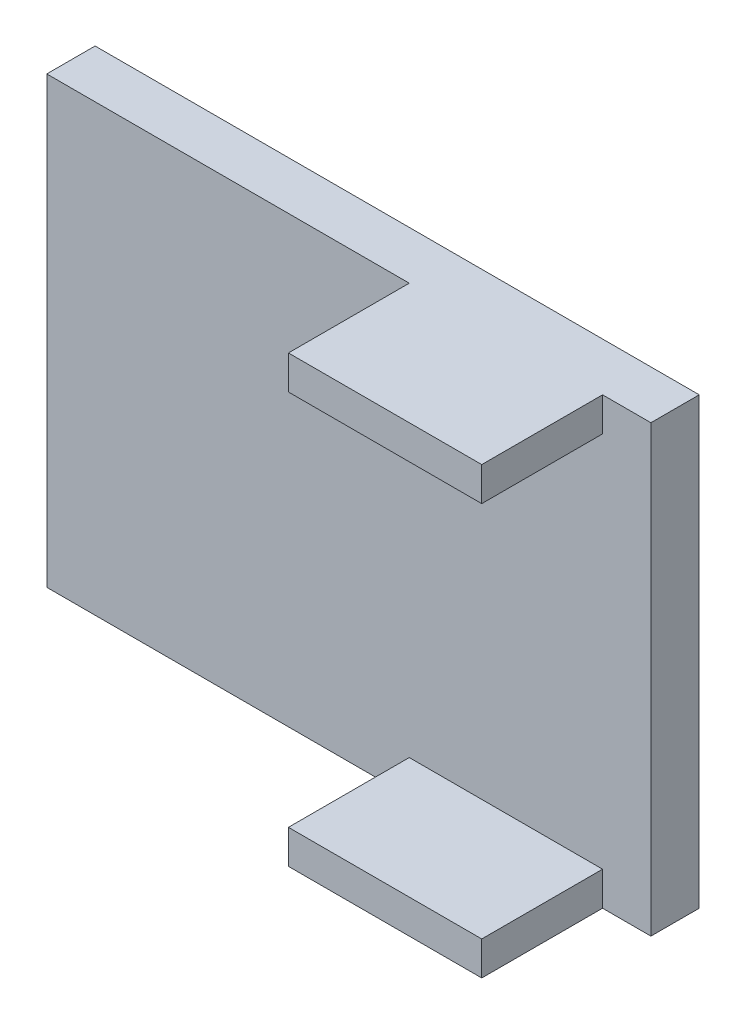
ISO-10303-21;
HEADER;
FILE_DESCRIPTION(('STEP AP214'),'2;1');
FILE_NAME('part.step','',(''),(''),'','','');
FILE_SCHEMA(('AUTOMOTIVE_DESIGN { 1 0 10303 214 1 1 1 1 }'));
ENDSEC;
DATA;
#1=APPLICATION_CONTEXT('core data for automotive mechanical design processes');
#2=APPLICATION_PROTOCOL_DEFINITION('international standard','automotive_design',2000,#1);
#3=PRODUCT_CONTEXT('',#1,'mechanical');
#4=PRODUCT('Part','Part','',(#3));
#5=PRODUCT_RELATED_PRODUCT_CATEGORY('part','',(#4));
#6=PRODUCT_DEFINITION_FORMATION('','',#4);
#7=PRODUCT_DEFINITION_CONTEXT('part definition',#1,'design');
#8=PRODUCT_DEFINITION('design','',#6,#7);
#9=PRODUCT_DEFINITION_SHAPE('','',#8);
#10=(LENGTH_UNIT() NAMED_UNIT(*) SI_UNIT(.MILLI.,.METRE.));
#11=(NAMED_UNIT(*) PLANE_ANGLE_UNIT() SI_UNIT($,.RADIAN.));
#12=(NAMED_UNIT(*) SI_UNIT($,.STERADIAN.) SOLID_ANGLE_UNIT());
#13=UNCERTAINTY_MEASURE_WITH_UNIT(LENGTH_MEASURE(1.E-05),#10,'distance_accuracy_value','');
#14=(GEOMETRIC_REPRESENTATION_CONTEXT(3) GLOBAL_UNCERTAINTY_ASSIGNED_CONTEXT((#13)) GLOBAL_UNIT_ASSIGNED_CONTEXT((#10,
#11,#12)) REPRESENTATION_CONTEXT('',''));
#15=CARTESIAN_POINT('',(0.,0.,0.));
#16=DIRECTION('',(0.,0.,1.));
#17=DIRECTION('',(1.,0.,0.));
#18=AXIS2_PLACEMENT_3D('',#15,#16,#17);
#19=CARTESIAN_POINT('',(0.,0.,2.54));
#20=DIRECTION('',(0.,0.,-1.));
#21=DIRECTION('',(-1.,0.,0.));
#22=AXIS2_PLACEMENT_3D('',#19,#20,#21);
#23=PLANE('',#22);
#24=DIRECTION('',(-1.,0.,0.));
#25=VECTOR('',#24,1.);
#26=CARTESIAN_POINT('',(15.875,-9.90599999999999,2.54));
#27=LINE('',#26,#25);
#28=CARTESIAN_POINT('',(13.335,-9.90599999999999,2.54));
#29=VERTEX_POINT('',#28);
#30=CARTESIAN_POINT('',(3.17500000000001,-9.90599999999999,2.54));
#31=VERTEX_POINT('',#30);
#32=EDGE_CURVE('E204',#29,#31,#27,.T.);
#33=ORIENTED_EDGE('',*,*,#32,.F.);
#34=DIRECTION('',(0.,1.,0.));
#35=VECTOR('',#34,1.);
#36=CARTESIAN_POINT('',(13.335,-11.684,2.54));
#37=LINE('',#36,#35);
#38=CARTESIAN_POINT('',(13.335,-11.684,2.54));
#39=VERTEX_POINT('',#38);
#40=EDGE_CURVE('E136',#39,#29,#37,.T.);
#41=ORIENTED_EDGE('',*,*,#40,.F.);
#42=DIRECTION('',(-1.,0.,0.));
#43=VECTOR('',#42,1.);
#44=CARTESIAN_POINT('',(15.875,-11.684,2.54));
#45=LINE('',#44,#43);
#46=CARTESIAN_POINT('',(15.875,-11.684,2.54));
#47=VERTEX_POINT('',#46);
#48=EDGE_CURVE('E134',#47,#39,#45,.T.);
#49=ORIENTED_EDGE('',*,*,#48,.F.);
#50=DIRECTION('',(0.,1.,0.));
#51=VECTOR('',#50,1.);
#52=CARTESIAN_POINT('',(15.875,-11.684,2.54));
#53=LINE('',#52,#51);
#54=CARTESIAN_POINT('',(15.875,11.684,2.54));
#55=VERTEX_POINT('',#54);
#56=EDGE_CURVE('E121',#47,#55,#53,.T.);
#57=ORIENTED_EDGE('',*,*,#56,.T.);
#58=DIRECTION('',(-1.,0.,0.));
#59=VECTOR('',#58,1.);
#60=CARTESIAN_POINT('',(15.875,11.684,2.54));
#61=LINE('',#60,#59);
#62=CARTESIAN_POINT('',(13.335,11.684,2.54));
#63=VERTEX_POINT('',#62);
#64=EDGE_CURVE('E221',#55,#63,#61,.T.);
#65=ORIENTED_EDGE('',*,*,#64,.T.);
#66=CARTESIAN_POINT('',(13.335,9.90600000000001,2.54));
#67=VERTEX_POINT('',#66);
#68=EDGE_CURVE('E218',#67,#63,#37,.T.);
#69=ORIENTED_EDGE('',*,*,#68,.F.);
#70=DIRECTION('',(1.,0.,0.));
#71=VECTOR('',#70,1.);
#72=CARTESIAN_POINT('',(15.875,9.90600000000001,2.54));
#73=LINE('',#72,#71);
#74=CARTESIAN_POINT('',(3.175,9.90600000000001,2.54));
#75=VERTEX_POINT('',#74);
#76=EDGE_CURVE('E181',#75,#67,#73,.T.);
#77=ORIENTED_EDGE('',*,*,#76,.F.);
#78=DIRECTION('',(0.,-1.,0.));
#79=VECTOR('',#78,1.);
#80=CARTESIAN_POINT('',(3.175,11.684,2.54));
#81=LINE('',#80,#79);
#82=CARTESIAN_POINT('',(3.175,11.684,2.54));
#83=VERTEX_POINT('',#82);
#84=EDGE_CURVE('E185',#83,#75,#81,.T.);
#85=ORIENTED_EDGE('',*,*,#84,.F.);
#86=DIRECTION('',(-1.,0.,0.));
#87=VECTOR('',#86,1.);
#88=CARTESIAN_POINT('',(-15.875,11.684,2.54));
#89=LINE('',#88,#87);
#90=CARTESIAN_POINT('',(-15.875,11.684,2.54));
#91=VERTEX_POINT('',#90);
#92=EDGE_CURVE('E130',#83,#91,#89,.T.);
#93=ORIENTED_EDGE('',*,*,#92,.T.);
#94=DIRECTION('',(0.,-1.,0.));
#95=VECTOR('',#94,1.);
#96=CARTESIAN_POINT('',(-15.875,-11.684,2.54));
#97=LINE('',#96,#95);
#98=CARTESIAN_POINT('',(-15.875,-11.684,2.54));
#99=VERTEX_POINT('',#98);
#100=EDGE_CURVE('E150',#91,#99,#97,.T.);
#101=ORIENTED_EDGE('',*,*,#100,.T.);
#102=DIRECTION('',(1.,0.,0.));
#103=VECTOR('',#102,1.);
#104=CARTESIAN_POINT('',(-15.875,-11.684,2.54));
#105=LINE('',#104,#103);
#106=CARTESIAN_POINT('',(3.17500000000001,-11.684,2.54));
#107=VERTEX_POINT('',#106);
#108=EDGE_CURVE('E147',#99,#107,#105,.T.);
#109=ORIENTED_EDGE('',*,*,#108,.T.);
#110=DIRECTION('',(0.,-1.,0.));
#111=VECTOR('',#110,1.);
#112=CARTESIAN_POINT('',(3.17500000000001,-11.684,2.54));
#113=LINE('',#112,#111);
#114=EDGE_CURVE('E200',#31,#107,#113,.T.);
#115=ORIENTED_EDGE('',*,*,#114,.F.);
#116=EDGE_LOOP('',(#33,#41,#49,#57,#65,#69,#77,#85,#93,#101,#109,#115));
#117=FACE_BOUND('',#116,.T.);
#118=ADVANCED_FACE('F34',(#117),#23,.F.);
#119=CARTESIAN_POINT('',(15.875,-11.684,2.54));
#120=DIRECTION('',(-1.,0.,0.));
#121=DIRECTION('',(0.,0.,1.));
#122=AXIS2_PLACEMENT_3D('',#119,#120,#121);
#123=PLANE('',#122);
#124=DIRECTION('',(0.,0.,-1.));
#125=VECTOR('',#124,1.);
#126=CARTESIAN_POINT('',(15.875,11.684,2.54));
#127=LINE('',#126,#125);
#128=CARTESIAN_POINT('',(15.875,11.684,0.));
#129=VERTEX_POINT('',#128);
#130=EDGE_CURVE('E11',#55,#129,#127,.T.);
#131=ORIENTED_EDGE('',*,*,#130,.F.);
#132=ORIENTED_EDGE('',*,*,#56,.F.);
#133=DIRECTION('',(0.,0.,-1.));
#134=VECTOR('',#133,1.);
#135=CARTESIAN_POINT('',(15.875,-11.684,2.54));
#136=LINE('',#135,#134);
#137=CARTESIAN_POINT('',(15.875,-11.684,0.));
#138=VERTEX_POINT('',#137);
#139=EDGE_CURVE('E125',#47,#138,#136,.T.);
#140=ORIENTED_EDGE('',*,*,#139,.T.);
#141=DIRECTION('',(0.,1.,0.));
#142=VECTOR('',#141,1.);
#143=CARTESIAN_POINT('',(15.875,-11.684,0.));
#144=LINE('',#143,#142);
#145=EDGE_CURVE('E168',#138,#129,#144,.T.);
#146=ORIENTED_EDGE('',*,*,#145,.T.);
#147=EDGE_LOOP('',(#131,#132,#140,#146));
#148=FACE_BOUND('',#147,.T.);
#149=ADVANCED_FACE('F36',(#148),#123,.F.);
#150=CARTESIAN_POINT('',(-15.875,11.684,2.54));
#151=DIRECTION('',(0.,-1.,0.));
#152=DIRECTION('',(0.,0.,-1.));
#153=AXIS2_PLACEMENT_3D('',#150,#151,#152);
#154=PLANE('',#153);
#155=DIRECTION('',(-1.,0.,0.));
#156=VECTOR('',#155,1.);
#157=CARTESIAN_POINT('',(15.875,11.684,8.89));
#158=LINE('',#157,#156);
#159=CARTESIAN_POINT('',(13.335,11.684,8.89));
#160=VERTEX_POINT('',#159);
#161=CARTESIAN_POINT('',(3.175,11.684,8.89));
#162=VERTEX_POINT('',#161);
#163=EDGE_CURVE('E184',#160,#162,#158,.T.);
#164=ORIENTED_EDGE('',*,*,#163,.F.);
#165=DIRECTION('',(0.,0.,1.));
#166=VECTOR('',#165,1.);
#167=CARTESIAN_POINT('',(13.335,11.684,8.89));
#168=LINE('',#167,#166);
#169=EDGE_CURVE('E49',#63,#160,#168,.T.);
#170=ORIENTED_EDGE('',*,*,#169,.F.);
#171=ORIENTED_EDGE('',*,*,#64,.F.);
#172=ORIENTED_EDGE('',*,*,#130,.T.);
#173=DIRECTION('',(-1.,0.,0.));
#174=VECTOR('',#173,1.);
#175=CARTESIAN_POINT('',(-15.875,11.684,0.));
#176=LINE('',#175,#174);
#177=CARTESIAN_POINT('',(-15.875,11.684,0.));
#178=VERTEX_POINT('',#177);
#179=EDGE_CURVE('E167',#129,#178,#176,.T.);
#180=ORIENTED_EDGE('',*,*,#179,.T.);
#181=DIRECTION('',(0.,0.,-1.));
#182=VECTOR('',#181,1.);
#183=CARTESIAN_POINT('',(-15.875,11.684,2.54));
#184=LINE('',#183,#182);
#185=EDGE_CURVE('E42',#91,#178,#184,.T.);
#186=ORIENTED_EDGE('',*,*,#185,.F.);
#187=ORIENTED_EDGE('',*,*,#92,.F.);
#188=DIRECTION('',(0.,0.,-1.));
#189=VECTOR('',#188,1.);
#190=CARTESIAN_POINT('',(3.175,11.684,8.89));
#191=LINE('',#190,#189);
#192=EDGE_CURVE('E171',#162,#83,#191,.T.);
#193=ORIENTED_EDGE('',*,*,#192,.F.);
#194=EDGE_LOOP('',(#164,#170,#171,#172,#180,#186,#187,#193));
#195=FACE_BOUND('',#194,.T.);
#196=ADVANCED_FACE('F227',(#195),#154,.F.);
#197=CARTESIAN_POINT('',(-15.875,-11.684,2.54));
#198=DIRECTION('',(1.,0.,0.));
#199=DIRECTION('',(0.,0.,-1.));
#200=AXIS2_PLACEMENT_3D('',#197,#198,#199);
#201=PLANE('',#200);
#202=DIRECTION('',(0.,-1.,0.));
#203=VECTOR('',#202,1.);
#204=CARTESIAN_POINT('',(-15.875,-11.684,0.));
#205=LINE('',#204,#203);
#206=CARTESIAN_POINT('',(-15.875,-11.684,0.));
#207=VERTEX_POINT('',#206);
#208=EDGE_CURVE('E161',#178,#207,#205,.T.);
#209=ORIENTED_EDGE('',*,*,#208,.T.);
#210=DIRECTION('',(0.,0.,-1.));
#211=VECTOR('',#210,1.);
#212=CARTESIAN_POINT('',(-15.875,-11.684,2.54));
#213=LINE('',#212,#211);
#214=EDGE_CURVE('E146',#99,#207,#213,.T.);
#215=ORIENTED_EDGE('',*,*,#214,.F.);
#216=ORIENTED_EDGE('',*,*,#100,.F.);
#217=ORIENTED_EDGE('',*,*,#185,.T.);
#218=EDGE_LOOP('',(#209,#215,#216,#217));
#219=FACE_BOUND('',#218,.T.);
#220=ADVANCED_FACE('F159',(#219),#201,.F.);
#221=CARTESIAN_POINT('',(-15.875,-11.684,2.54));
#222=DIRECTION('',(0.,1.,0.));
#223=DIRECTION('',(0.,0.,1.));
#224=AXIS2_PLACEMENT_3D('',#221,#222,#223);
#225=PLANE('',#224);
#226=ORIENTED_EDGE('',*,*,#48,.T.);
#227=DIRECTION('',(0.,0.,1.));
#228=VECTOR('',#227,1.);
#229=CARTESIAN_POINT('',(13.335,-11.684,8.89));
#230=LINE('',#229,#228);
#231=CARTESIAN_POINT('',(13.335,-11.684,8.89));
#232=VERTEX_POINT('',#231);
#233=EDGE_CURVE('E140',#39,#232,#230,.T.);
#234=ORIENTED_EDGE('',*,*,#233,.T.);
#235=DIRECTION('',(1.,0.,0.));
#236=VECTOR('',#235,1.);
#237=CARTESIAN_POINT('',(15.875,-11.684,8.89));
#238=LINE('',#237,#236);
#239=CARTESIAN_POINT('',(3.17500000000001,-11.684,8.89));
#240=VERTEX_POINT('',#239);
#241=EDGE_CURVE('E199',#240,#232,#238,.T.);
#242=ORIENTED_EDGE('',*,*,#241,.F.);
#243=DIRECTION('',(0.,0.,-1.));
#244=VECTOR('',#243,1.);
#245=CARTESIAN_POINT('',(3.17500000000001,-11.684,8.89));
#246=LINE('',#245,#244);
#247=EDGE_CURVE('E196',#240,#107,#246,.T.);
#248=ORIENTED_EDGE('',*,*,#247,.T.);
#249=ORIENTED_EDGE('',*,*,#108,.F.);
#250=ORIENTED_EDGE('',*,*,#214,.T.);
#251=DIRECTION('',(1.,0.,0.));
#252=VECTOR('',#251,1.);
#253=CARTESIAN_POINT('',(-15.875,-11.684,0.));
#254=LINE('',#253,#252);
#255=EDGE_CURVE('E131',#207,#138,#254,.T.);
#256=ORIENTED_EDGE('',*,*,#255,.T.);
#257=ORIENTED_EDGE('',*,*,#139,.F.);
#258=EDGE_LOOP('',(#226,#234,#242,#248,#249,#250,#256,#257));
#259=FACE_BOUND('',#258,.T.);
#260=ADVANCED_FACE('F142',(#259),#225,.F.);
#261=CARTESIAN_POINT('',(0.,0.,0.));
#262=DIRECTION('',(0.,0.,-1.));
#263=DIRECTION('',(-1.,0.,0.));
#264=AXIS2_PLACEMENT_3D('',#261,#262,#263);
#265=PLANE('',#264);
#266=ORIENTED_EDGE('',*,*,#145,.F.);
#267=ORIENTED_EDGE('',*,*,#255,.F.);
#268=ORIENTED_EDGE('',*,*,#208,.F.);
#269=ORIENTED_EDGE('',*,*,#179,.F.);
#270=EDGE_LOOP('',(#266,#267,#268,#269));
#271=FACE_BOUND('',#270,.T.);
#272=ADVANCED_FACE('F166',(#271),#265,.T.);
#273=CARTESIAN_POINT('',(3.175,11.684,8.89));
#274=DIRECTION('',(1.,0.,0.));
#275=DIRECTION('',(0.,0.,-1.));
#276=AXIS2_PLACEMENT_3D('',#273,#274,#275);
#277=PLANE('',#276);
#278=ORIENTED_EDGE('',*,*,#84,.T.);
#279=DIRECTION('',(0.,0.,-1.));
#280=VECTOR('',#279,1.);
#281=CARTESIAN_POINT('',(3.175,9.90600000000001,8.89));
#282=LINE('',#281,#280);
#283=CARTESIAN_POINT('',(3.175,9.90600000000001,8.89));
#284=VERTEX_POINT('',#283);
#285=EDGE_CURVE('E177',#284,#75,#282,.T.);
#286=ORIENTED_EDGE('',*,*,#285,.F.);
#287=DIRECTION('',(0.,-1.,0.));
#288=VECTOR('',#287,1.);
#289=CARTESIAN_POINT('',(3.175,11.684,8.89));
#290=LINE('',#289,#288);
#291=EDGE_CURVE('E191',#162,#284,#290,.T.);
#292=ORIENTED_EDGE('',*,*,#291,.F.);
#293=ORIENTED_EDGE('',*,*,#192,.T.);
#294=EDGE_LOOP('',(#278,#286,#292,#293));
#295=FACE_BOUND('',#294,.T.);
#296=ADVANCED_FACE('F237',(#295),#277,.F.);
#297=CARTESIAN_POINT('',(15.875,9.90600000000001,8.89));
#298=DIRECTION('',(0.,1.,0.));
#299=DIRECTION('',(-1.,0.,0.));
#300=AXIS2_PLACEMENT_3D('',#297,#298,#299);
#301=PLANE('',#300);
#302=ORIENTED_EDGE('',*,*,#76,.T.);
#303=DIRECTION('',(0.,0.,1.));
#304=VECTOR('',#303,1.);
#305=CARTESIAN_POINT('',(13.335,9.90600000000001,8.89));
#306=LINE('',#305,#304);
#307=CARTESIAN_POINT('',(13.335,9.90600000000001,8.89));
#308=VERTEX_POINT('',#307);
#309=EDGE_CURVE('E206',#67,#308,#306,.T.);
#310=ORIENTED_EDGE('',*,*,#309,.T.);
#311=DIRECTION('',(1.,0.,0.));
#312=VECTOR('',#311,1.);
#313=CARTESIAN_POINT('',(15.875,9.90600000000001,8.89));
#314=LINE('',#313,#312);
#315=EDGE_CURVE('E180',#284,#308,#314,.T.);
#316=ORIENTED_EDGE('',*,*,#315,.F.);
#317=ORIENTED_EDGE('',*,*,#285,.T.);
#318=EDGE_LOOP('',(#302,#310,#316,#317));
#319=FACE_BOUND('',#318,.T.);
#320=ADVANCED_FACE('F235',(#319),#301,.F.);
#321=CARTESIAN_POINT('',(0.,0.,8.89));
#322=DIRECTION('',(0.,0.,-1.));
#323=DIRECTION('',(-1.,0.,0.));
#324=AXIS2_PLACEMENT_3D('',#321,#322,#323);
#325=PLANE('',#324);
#326=ORIENTED_EDGE('',*,*,#315,.T.);
#327=DIRECTION('',(0.,1.,0.));
#328=VECTOR('',#327,1.);
#329=CARTESIAN_POINT('',(13.335,-11.684,8.89));
#330=LINE('',#329,#328);
#331=EDGE_CURVE('E217',#308,#160,#330,.T.);
#332=ORIENTED_EDGE('',*,*,#331,.T.);
#333=ORIENTED_EDGE('',*,*,#163,.T.);
#334=ORIENTED_EDGE('',*,*,#291,.T.);
#335=EDGE_LOOP('',(#326,#332,#333,#334));
#336=FACE_BOUND('',#335,.T.);
#337=ADVANCED_FACE('F231',(#336),#325,.F.);
#338=CARTESIAN_POINT('',(15.875,-9.90599999999999,8.89));
#339=DIRECTION('',(0.,-1.,0.));
#340=DIRECTION('',(1.,0.,0.));
#341=AXIS2_PLACEMENT_3D('',#338,#339,#340);
#342=PLANE('',#341);
#343=DIRECTION('',(-1.,0.,0.));
#344=VECTOR('',#343,1.);
#345=CARTESIAN_POINT('',(15.875,-9.90599999999999,8.89));
#346=LINE('',#345,#344);
#347=CARTESIAN_POINT('',(13.335,-9.90599999999999,8.89));
#348=VERTEX_POINT('',#347);
#349=CARTESIAN_POINT('',(3.17500000000001,-9.90599999999999,8.89));
#350=VERTEX_POINT('',#349);
#351=EDGE_CURVE('E203',#348,#350,#346,.T.);
#352=ORIENTED_EDGE('',*,*,#351,.F.);
#353=DIRECTION('',(0.,0.,-1.));
#354=VECTOR('',#353,1.);
#355=CARTESIAN_POINT('',(13.335,-9.90599999999999,8.89));
#356=LINE('',#355,#354);
#357=EDGE_CURVE('E57',#348,#29,#356,.T.);
#358=ORIENTED_EDGE('',*,*,#357,.T.);
#359=ORIENTED_EDGE('',*,*,#32,.T.);
#360=DIRECTION('',(0.,0.,-1.));
#361=VECTOR('',#360,1.);
#362=CARTESIAN_POINT('',(3.17500000000001,-9.90599999999999,8.89));
#363=LINE('',#362,#361);
#364=EDGE_CURVE('E188',#350,#31,#363,.T.);
#365=ORIENTED_EDGE('',*,*,#364,.F.);
#366=EDGE_LOOP('',(#352,#358,#359,#365));
#367=FACE_BOUND('',#366,.T.);
#368=ADVANCED_FACE('F276',(#367),#342,.F.);
#369=CARTESIAN_POINT('',(3.17500000000001,-11.684,8.89));
#370=DIRECTION('',(1.,0.,0.));
#371=DIRECTION('',(0.,0.,-1.));
#372=AXIS2_PLACEMENT_3D('',#369,#370,#371);
#373=PLANE('',#372);
#374=ORIENTED_EDGE('',*,*,#114,.T.);
#375=ORIENTED_EDGE('',*,*,#247,.F.);
#376=DIRECTION('',(0.,-1.,0.));
#377=VECTOR('',#376,1.);
#378=CARTESIAN_POINT('',(3.17500000000001,-11.684,8.89));
#379=LINE('',#378,#377);
#380=EDGE_CURVE('E209',#350,#240,#379,.T.);
#381=ORIENTED_EDGE('',*,*,#380,.F.);
#382=ORIENTED_EDGE('',*,*,#364,.T.);
#383=EDGE_LOOP('',(#374,#375,#381,#382));
#384=FACE_BOUND('',#383,.T.);
#385=ADVANCED_FACE('F283',(#384),#373,.F.);
#386=CARTESIAN_POINT('',(0.,0.,8.89));
#387=DIRECTION('',(0.,0.,1.));
#388=DIRECTION('',(1.,0.,0.));
#389=AXIS2_PLACEMENT_3D('',#386,#387,#388);
#390=PLANE('',#389);
#391=EDGE_CURVE('E215',#232,#348,#330,.T.);
#392=ORIENTED_EDGE('',*,*,#391,.T.);
#393=ORIENTED_EDGE('',*,*,#351,.T.);
#394=ORIENTED_EDGE('',*,*,#380,.T.);
#395=ORIENTED_EDGE('',*,*,#241,.T.);
#396=EDGE_LOOP('',(#392,#393,#394,#395));
#397=FACE_BOUND('',#396,.T.);
#398=ADVANCED_FACE('F289',(#397),#390,.T.);
#399=CARTESIAN_POINT('',(13.335,-11.684,8.89));
#400=DIRECTION('',(-1.,0.,0.));
#401=DIRECTION('',(0.,0.,1.));
#402=AXIS2_PLACEMENT_3D('',#399,#400,#401);
#403=PLANE('',#402);
#404=ORIENTED_EDGE('',*,*,#391,.F.);
#405=ORIENTED_EDGE('',*,*,#233,.F.);
#406=ORIENTED_EDGE('',*,*,#40,.T.);
#407=ORIENTED_EDGE('',*,*,#357,.F.);
#408=EDGE_LOOP('',(#404,#405,#406,#407));
#409=FACE_BOUND('',#408,.T.);
#410=ADVANCED_FACE('F292',(#409),#403,.F.);
#411=ORIENTED_EDGE('',*,*,#68,.T.);
#412=ORIENTED_EDGE('',*,*,#169,.T.);
#413=ORIENTED_EDGE('',*,*,#331,.F.);
#414=ORIENTED_EDGE('',*,*,#309,.F.);
#415=EDGE_LOOP('',(#411,#412,#413,#414));
#416=FACE_BOUND('',#415,.T.);
#417=ADVANCED_FACE('F225',(#416),#403,.F.);
#418=CLOSED_SHELL('',(#118,#149,#196,#220,#260,#272,#296,#320,#337,#368,#385,#398,#410,#417));
#419=MANIFOLD_SOLID_BREP('B2',#418);
#420=ADVANCED_BREP_SHAPE_REPRESENTATION('',(#18,#419),#14);
#421=SHAPE_DEFINITION_REPRESENTATION(#9,#420);
ENDSEC;
END-ISO-10303-21;
